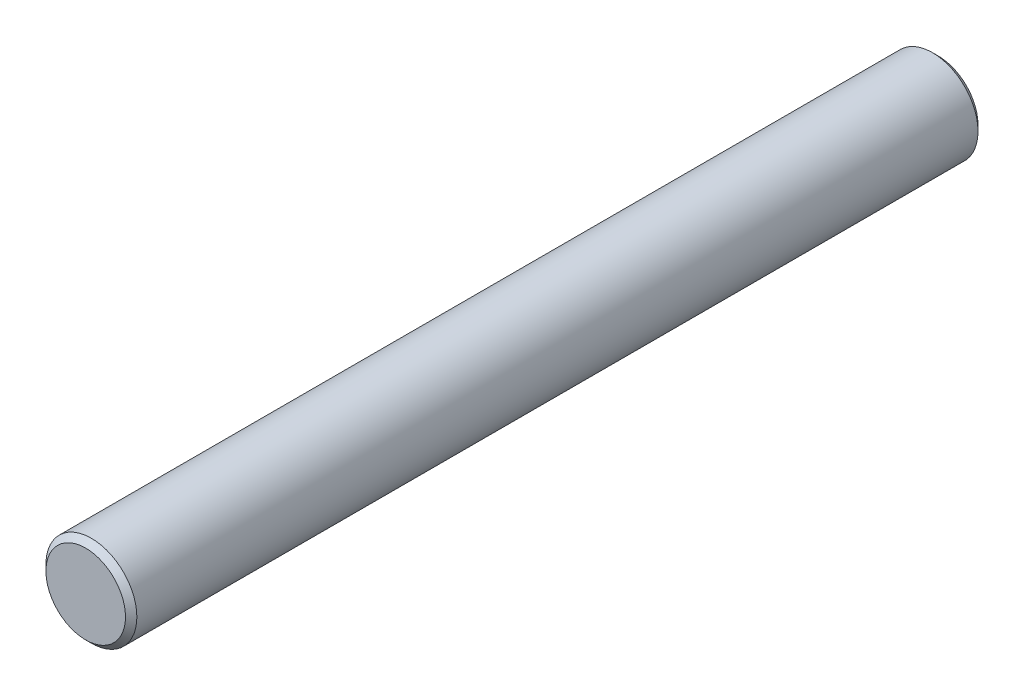
ISO-10303-21;
HEADER;
FILE_DESCRIPTION(('STEP AP214'),'2;1');
FILE_NAME('part.step','',(''),(''),'','','');
FILE_SCHEMA(('AUTOMOTIVE_DESIGN { 1 0 10303 214 1 1 1 1 }'));
ENDSEC;
DATA;
#1=APPLICATION_CONTEXT('core data for automotive mechanical design processes');
#2=APPLICATION_PROTOCOL_DEFINITION('international standard','automotive_design',2000,#1);
#3=PRODUCT_CONTEXT('',#1,'mechanical');
#4=PRODUCT('Part','Part','',(#3));
#5=PRODUCT_RELATED_PRODUCT_CATEGORY('part','',(#4));
#6=PRODUCT_DEFINITION_FORMATION('','',#4);
#7=PRODUCT_DEFINITION_CONTEXT('part definition',#1,'design');
#8=PRODUCT_DEFINITION('design','',#6,#7);
#9=PRODUCT_DEFINITION_SHAPE('','',#8);
#10=(LENGTH_UNIT() NAMED_UNIT(*) SI_UNIT(.MILLI.,.METRE.));
#11=(NAMED_UNIT(*) PLANE_ANGLE_UNIT() SI_UNIT($,.RADIAN.));
#12=(NAMED_UNIT(*) SI_UNIT($,.STERADIAN.) SOLID_ANGLE_UNIT());
#13=UNCERTAINTY_MEASURE_WITH_UNIT(LENGTH_MEASURE(1.E-05),#10,'distance_accuracy_value','');
#14=(GEOMETRIC_REPRESENTATION_CONTEXT(3) GLOBAL_UNCERTAINTY_ASSIGNED_CONTEXT((#13)) GLOBAL_UNIT_ASSIGNED_CONTEXT((#10,
#11,#12)) REPRESENTATION_CONTEXT('',''));
#15=CARTESIAN_POINT('',(0.,0.,0.));
#16=DIRECTION('',(0.,0.,1.));
#17=DIRECTION('',(1.,0.,0.));
#18=AXIS2_PLACEMENT_3D('',#15,#16,#17);
#19=CARTESIAN_POINT('',(0.,0.,75.));
#20=DIRECTION('',(0.,0.,-1.));
#21=DIRECTION('',(-1.,0.,0.));
#22=AXIS2_PLACEMENT_3D('',#19,#20,#21);
#23=CYLINDRICAL_SURFACE('',#22,4.);
#24=CARTESIAN_POINT('',(0.,0.,0.500000000000014));
#25=DIRECTION('',(0.,0.,1.));
#26=DIRECTION('',(1.,0.,0.));
#27=AXIS2_PLACEMENT_3D('',#24,#25,#26);
#28=CIRCLE('',#27,4.);
#29=CARTESIAN_POINT('',(4.,0.,0.500000000000014));
#30=VERTEX_POINT('',#29);
#31=EDGE_CURVE('E53',#30,#30,#28,.T.);
#32=ORIENTED_EDGE('',*,*,#31,.T.);
#33=EDGE_LOOP('',(#32));
#34=FACE_BOUND('',#33,.T.);
#35=CARTESIAN_POINT('',(0.,0.,74.5));
#36=DIRECTION('',(0.,0.,1.));
#37=DIRECTION('',(1.,0.,0.));
#38=AXIS2_PLACEMENT_3D('',#35,#36,#37);
#39=CIRCLE('',#38,4.);
#40=CARTESIAN_POINT('',(4.,0.,74.5));
#41=VERTEX_POINT('',#40);
#42=EDGE_CURVE('E58',#41,#41,#39,.F.);
#43=ORIENTED_EDGE('',*,*,#42,.T.);
#44=EDGE_LOOP('',(#43));
#45=FACE_BOUND('',#44,.T.);
#46=ADVANCED_FACE('F39',(#34,#45),#23,.T.);
#47=CARTESIAN_POINT('',(0.,0.,75.));
#48=DIRECTION('',(0.,0.,1.));
#49=DIRECTION('',(1.,0.,0.));
#50=AXIS2_PLACEMENT_3D('',#47,#48,#49);
#51=PLANE('',#50);
#52=CARTESIAN_POINT('',(0.,0.,75.));
#53=DIRECTION('',(0.,0.,1.));
#54=DIRECTION('',(1.,0.,0.));
#55=AXIS2_PLACEMENT_3D('',#52,#53,#54);
#56=CIRCLE('',#55,3.5);
#57=CARTESIAN_POINT('',(3.5,0.,75.));
#58=VERTEX_POINT('',#57);
#59=EDGE_CURVE('E10',#58,#58,#56,.T.);
#60=ORIENTED_EDGE('',*,*,#59,.T.);
#61=EDGE_LOOP('',(#60));
#62=FACE_BOUND('',#61,.T.);
#63=ADVANCED_FACE('F75',(#62),#51,.T.);
#64=CARTESIAN_POINT('',(0.,0.,0.));
#65=DIRECTION('',(0.,0.,1.));
#66=DIRECTION('',(1.,0.,0.));
#67=AXIS2_PLACEMENT_3D('',#64,#65,#66);
#68=PLANE('',#67);
#69=CARTESIAN_POINT('',(0.,0.,0.));
#70=DIRECTION('',(0.,0.,1.));
#71=DIRECTION('',(1.,0.,0.));
#72=AXIS2_PLACEMENT_3D('',#69,#70,#71);
#73=CIRCLE('',#72,3.49999999999999);
#74=CARTESIAN_POINT('',(3.49999999999999,0.,0.));
#75=VERTEX_POINT('',#74);
#76=EDGE_CURVE('E48',#75,#75,#73,.F.);
#77=ORIENTED_EDGE('',*,*,#76,.T.);
#78=EDGE_LOOP('',(#77));
#79=FACE_BOUND('',#78,.T.);
#80=ADVANCED_FACE('F72',(#79),#68,.F.);
#81=CARTESIAN_POINT('',(0.,0.,0.500000000000014));
#82=DIRECTION('',(0.,0.,1.));
#83=DIRECTION('',(1.,0.,0.));
#84=AXIS2_PLACEMENT_3D('',#81,#82,#83);
#85=CONICAL_SURFACE('',#84,4.,0.785398163397445);
#86=ORIENTED_EDGE('',*,*,#76,.F.);
#87=EDGE_LOOP('',(#86));
#88=FACE_BOUND('',#87,.T.);
#89=ORIENTED_EDGE('',*,*,#31,.F.);
#90=EDGE_LOOP('',(#89));
#91=FACE_BOUND('',#90,.T.);
#92=ADVANCED_FACE('F68',(#88,#91),#85,.T.);
#93=CARTESIAN_POINT('',(0.,0.,75.));
#94=DIRECTION('',(0.,0.,-1.));
#95=DIRECTION('',(-1.,0.,0.));
#96=AXIS2_PLACEMENT_3D('',#93,#94,#95);
#97=CONICAL_SURFACE('',#96,3.5,0.785398163397452);
#98=ORIENTED_EDGE('',*,*,#42,.F.);
#99=EDGE_LOOP('',(#98));
#100=FACE_BOUND('',#99,.T.);
#101=ORIENTED_EDGE('',*,*,#59,.F.);
#102=EDGE_LOOP('',(#101));
#103=FACE_BOUND('',#102,.T.);
#104=ADVANCED_FACE('F42',(#100,#103),#97,.T.);
#105=CLOSED_SHELL('',(#46,#63,#80,#92,#104));
#106=MANIFOLD_SOLID_BREP('B2',#105);
#107=ADVANCED_BREP_SHAPE_REPRESENTATION('',(#18,#106),#14);
#108=SHAPE_DEFINITION_REPRESENTATION(#9,#107);
ENDSEC;
END-ISO-10303-21;
